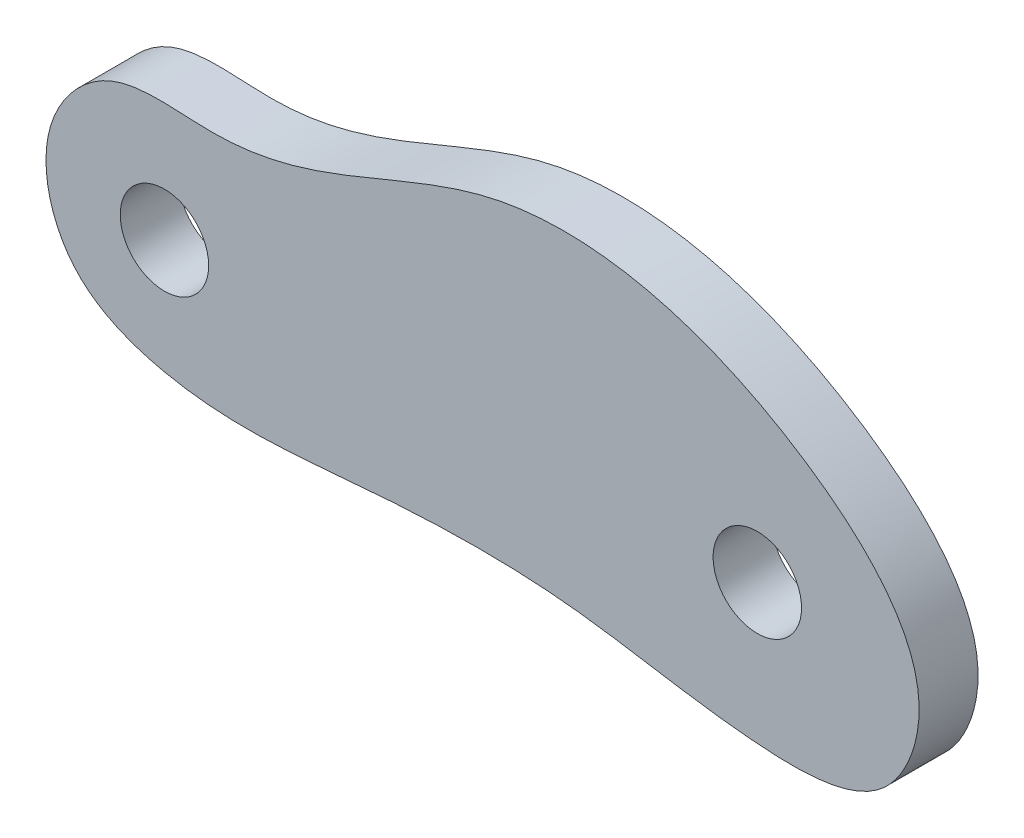
ISO-10303-21;
HEADER;
FILE_DESCRIPTION(('STEP AP214'),'2;1');
FILE_NAME('part.step','',(''),(''),'','','');
FILE_SCHEMA(('AUTOMOTIVE_DESIGN { 1 0 10303 214 1 1 1 1 }'));
ENDSEC;
DATA;
#1=APPLICATION_CONTEXT('core data for automotive mechanical design processes');
#2=APPLICATION_PROTOCOL_DEFINITION('international standard','automotive_design',2000,#1);
#3=PRODUCT_CONTEXT('',#1,'mechanical');
#4=PRODUCT('Part','Part','',(#3));
#5=PRODUCT_RELATED_PRODUCT_CATEGORY('part','',(#4));
#6=PRODUCT_DEFINITION_FORMATION('','',#4);
#7=PRODUCT_DEFINITION_CONTEXT('part definition',#1,'design');
#8=PRODUCT_DEFINITION('design','',#6,#7);
#9=PRODUCT_DEFINITION_SHAPE('','',#8);
#10=(LENGTH_UNIT() NAMED_UNIT(*) SI_UNIT(.MILLI.,.METRE.));
#11=(NAMED_UNIT(*) PLANE_ANGLE_UNIT() SI_UNIT($,.RADIAN.));
#12=(NAMED_UNIT(*) SI_UNIT($,.STERADIAN.) SOLID_ANGLE_UNIT());
#13=UNCERTAINTY_MEASURE_WITH_UNIT(LENGTH_MEASURE(1.E-05),#10,'distance_accuracy_value','');
#14=(GEOMETRIC_REPRESENTATION_CONTEXT(3) GLOBAL_UNCERTAINTY_ASSIGNED_CONTEXT((#13)) GLOBAL_UNIT_ASSIGNED_CONTEXT((#10,
#11,#12)) REPRESENTATION_CONTEXT('',''));
#15=CARTESIAN_POINT('',(0.,0.,0.));
#16=DIRECTION('',(0.,0.,1.));
#17=DIRECTION('',(1.,0.,0.));
#18=AXIS2_PLACEMENT_3D('',#15,#16,#17);
#19=CARTESIAN_POINT('',(290.900340611058,233.920899702614,3.175));
#20=DIRECTION('',(0.,0.,1.));
#21=DIRECTION('',(1.,0.,0.));
#22=AXIS2_PLACEMENT_3D('',#19,#20,#21);
#23=PLANE('',#22);
#24=CARTESIAN_POINT('',(288.590792316979,226.806176414792,3.175));
#25=DIRECTION('',(0.,0.,1.));
#26=DIRECTION('',(1.,0.,0.));
#27=AXIS2_PLACEMENT_3D('',#24,#25,#26);
#28=CIRCLE('',#27,2.38125);
#29=CARTESIAN_POINT('',(290.972042316979,226.806176414792,3.175));
#30=VERTEX_POINT('',#29);
#31=EDGE_CURVE('E44',#30,#30,#28,.T.);
#32=ORIENTED_EDGE('',*,*,#31,.F.);
#33=EDGE_LOOP('',(#32));
#34=FACE_BOUND('',#33,.T.);
#35=CARTESIAN_POINT('',(256.656307693738,220.658361193206,3.175));
#36=CARTESIAN_POINT('',(260.423337659457,219.853384523781,3.175));
#37=CARTESIAN_POINT('',(267.648367821438,220.846256465153,3.175));
#38=CARTESIAN_POINT('',(278.527072620477,221.094526863317,3.175));
#39=CARTESIAN_POINT('',(287.150183959934,219.05403458651,3.175));
#40=CARTESIAN_POINT('',(295.537354238172,219.161240785766,3.175));
#41=CARTESIAN_POINT('',(298.833553425491,227.380636013771,3.175));
#42=CARTESIAN_POINT('',(289.391955013536,236.438949770959,3.175));
#43=CARTESIAN_POINT('',(275.584344015788,239.766153097396,3.175));
#44=CARTESIAN_POINT('',(265.796638062921,233.919150187918,3.175));
#45=CARTESIAN_POINT('',(258.820760461558,232.851791162162,3.175));
#46=CARTESIAN_POINT('',(253.689223289616,233.825733292952,3.175));
#47=CARTESIAN_POINT('',(249.433947251004,228.891650402123,3.175));
#48=CARTESIAN_POINT('',(251.013480448775,222.495951076838,3.175));
#49=CARTESIAN_POINT('',(254.869539647181,221.040175674174,3.175));
#50=CARTESIAN_POINT('',(256.656307693738,220.658361193206,3.175));
#51=B_SPLINE_CURVE_WITH_KNOTS('',3,(#35,#36,#37,#38,#39,#40,#41,#42,#43,#44,#45,#46,#47,#48,#49,
#50),.UNSPECIFIED.,.T.,.F.,(4,1,1,1,1,1,1,1,1,1,1,1,1,4),(0.,0.103028869803125,
0.199813565678789,0.292757942522224,0.356436271927018,0.399073053433096,0.500876549283804,
0.655805691183925,0.763438478940793,0.798099269163629,0.849708226043579,0.895086017480275,
0.95113160922202,1.),.UNSPECIFIED.);
#52=CARTESIAN_POINT('',(256.656307693738,220.658361193206,3.175));
#53=VERTEX_POINT('',#52);
#54=EDGE_CURVE('E10',#53,#53,#51,.T.);
#55=ORIENTED_EDGE('',*,*,#54,.T.);
#56=EDGE_LOOP('',(#55));
#57=FACE_BOUND('',#56,.T.);
#58=CARTESIAN_POINT('',(256.656307693738,226.806176414792,3.175));
#59=DIRECTION('',(0.,0.,1.));
#60=DIRECTION('',(1.,0.,0.));
#61=AXIS2_PLACEMENT_3D('',#58,#59,#60);
#62=CIRCLE('',#61,2.38125);
#63=CARTESIAN_POINT('',(259.037557693738,226.806176414792,3.175));
#64=VERTEX_POINT('',#63);
#65=EDGE_CURVE('E55',#64,#64,#62,.T.);
#66=ORIENTED_EDGE('',*,*,#65,.F.);
#67=EDGE_LOOP('',(#66));
#68=FACE_BOUND('',#67,.T.);
#69=ADVANCED_FACE('F31',(#34,#57,#68),#23,.T.);
#70=CARTESIAN_POINT('',(290.900340611058,233.920899702614,0.));
#71=DIRECTION('',(0.,0.,1.));
#72=DIRECTION('',(1.,0.,0.));
#73=AXIS2_PLACEMENT_3D('',#70,#71,#72);
#74=PLANE('',#73);
#75=CARTESIAN_POINT('',(256.656307693738,220.658361193206,0.));
#76=CARTESIAN_POINT('',(260.423337659457,219.853384523781,0.));
#77=CARTESIAN_POINT('',(267.648367821438,220.846256465153,0.));
#78=CARTESIAN_POINT('',(278.527072620477,221.094526863317,0.));
#79=CARTESIAN_POINT('',(287.150183959934,219.05403458651,0.));
#80=CARTESIAN_POINT('',(295.537354238172,219.161240785766,0.));
#81=CARTESIAN_POINT('',(298.833553425491,227.380636013771,0.));
#82=CARTESIAN_POINT('',(289.391955013536,236.438949770959,0.));
#83=CARTESIAN_POINT('',(275.584344015788,239.766153097396,0.));
#84=CARTESIAN_POINT('',(265.796638062921,233.919150187918,0.));
#85=CARTESIAN_POINT('',(258.820760461558,232.851791162162,0.));
#86=CARTESIAN_POINT('',(253.689223289616,233.825733292952,0.));
#87=CARTESIAN_POINT('',(249.433947251004,228.891650402123,0.));
#88=CARTESIAN_POINT('',(251.013480448775,222.495951076838,0.));
#89=CARTESIAN_POINT('',(254.869539647181,221.040175674174,0.));
#90=CARTESIAN_POINT('',(256.656307693738,220.658361193206,0.));
#91=B_SPLINE_CURVE_WITH_KNOTS('',3,(#75,#76,#77,#78,#79,#80,#81,#82,#83,#84,#85,#86,#87,#88,#89,
#90),.UNSPECIFIED.,.T.,.F.,(4,1,1,1,1,1,1,1,1,1,1,1,1,4),(0.,0.103028869803125,
0.199813565678789,0.292757942522224,0.356436271927018,0.399073053433096,0.500876549283804,
0.655805691183925,0.763438478940793,0.798099269163629,0.849708226043579,0.895086017480275,
0.95113160922202,1.),.UNSPECIFIED.);
#92=CARTESIAN_POINT('',(256.656307693738,220.658361193206,0.));
#93=VERTEX_POINT('',#92);
#94=EDGE_CURVE('E36',#93,#93,#91,.T.);
#95=ORIENTED_EDGE('',*,*,#94,.F.);
#96=EDGE_LOOP('',(#95));
#97=FACE_BOUND('',#96,.T.);
#98=CARTESIAN_POINT('',(288.590792316979,226.806176414792,0.));
#99=DIRECTION('',(0.,0.,1.));
#100=DIRECTION('',(1.,0.,0.));
#101=AXIS2_PLACEMENT_3D('',#98,#99,#100);
#102=CIRCLE('',#101,2.38125);
#103=CARTESIAN_POINT('',(290.972042316979,226.806176414792,0.));
#104=VERTEX_POINT('',#103);
#105=EDGE_CURVE('E49',#104,#104,#102,.T.);
#106=ORIENTED_EDGE('',*,*,#105,.T.);
#107=EDGE_LOOP('',(#106));
#108=FACE_BOUND('',#107,.T.);
#109=CARTESIAN_POINT('',(256.656307693738,226.806176414792,0.));
#110=DIRECTION('',(0.,0.,1.));
#111=DIRECTION('',(1.,0.,0.));
#112=AXIS2_PLACEMENT_3D('',#109,#110,#111);
#113=CIRCLE('',#112,2.38125);
#114=CARTESIAN_POINT('',(259.037557693738,226.806176414792,0.));
#115=VERTEX_POINT('',#114);
#116=EDGE_CURVE('E58',#115,#115,#113,.T.);
#117=ORIENTED_EDGE('',*,*,#116,.T.);
#118=EDGE_LOOP('',(#117));
#119=FACE_BOUND('',#118,.T.);
#120=ADVANCED_FACE('F68',(#97,#108,#119),#74,.F.);
#121=DIRECTION('',(0.,0.,-1.));
#122=VECTOR('',#121,1.);
#123=SURFACE_OF_LINEAR_EXTRUSION('',#51,#122);
#124=ORIENTED_EDGE('',*,*,#54,.F.);
#125=EDGE_LOOP('',(#124));
#126=FACE_BOUND('',#125,.T.);
#127=ORIENTED_EDGE('',*,*,#94,.T.);
#128=EDGE_LOOP('',(#127));
#129=FACE_BOUND('',#128,.T.);
#130=ADVANCED_FACE('F33',(#126,#129),#123,.F.);
#131=CARTESIAN_POINT('',(288.590792316979,226.806176414792,3.175));
#132=DIRECTION('',(0.,0.,-1.));
#133=DIRECTION('',(-1.,0.,0.));
#134=AXIS2_PLACEMENT_3D('',#131,#132,#133);
#135=CYLINDRICAL_SURFACE('',#134,2.38125);
#136=ORIENTED_EDGE('',*,*,#31,.T.);
#137=EDGE_LOOP('',(#136));
#138=FACE_BOUND('',#137,.T.);
#139=ORIENTED_EDGE('',*,*,#105,.F.);
#140=EDGE_LOOP('',(#139));
#141=FACE_BOUND('',#140,.T.);
#142=ADVANCED_FACE('F77',(#138,#141),#135,.F.);
#143=CARTESIAN_POINT('',(256.656307693738,226.806176414792,3.175));
#144=DIRECTION('',(0.,0.,-1.));
#145=DIRECTION('',(-1.,0.,0.));
#146=AXIS2_PLACEMENT_3D('',#143,#144,#145);
#147=CYLINDRICAL_SURFACE('',#146,2.38125);
#148=ORIENTED_EDGE('',*,*,#65,.T.);
#149=EDGE_LOOP('',(#148));
#150=FACE_BOUND('',#149,.T.);
#151=ORIENTED_EDGE('',*,*,#116,.F.);
#152=EDGE_LOOP('',(#151));
#153=FACE_BOUND('',#152,.T.);
#154=ADVANCED_FACE('F64',(#150,#153),#147,.F.);
#155=CLOSED_SHELL('',(#69,#120,#130,#142,#154));
#156=MANIFOLD_SOLID_BREP('B2',#155);
#157=ADVANCED_BREP_SHAPE_REPRESENTATION('',(#18,#156),#14);
#158=SHAPE_DEFINITION_REPRESENTATION(#9,#157);
ENDSEC;
END-ISO-10303-21;
